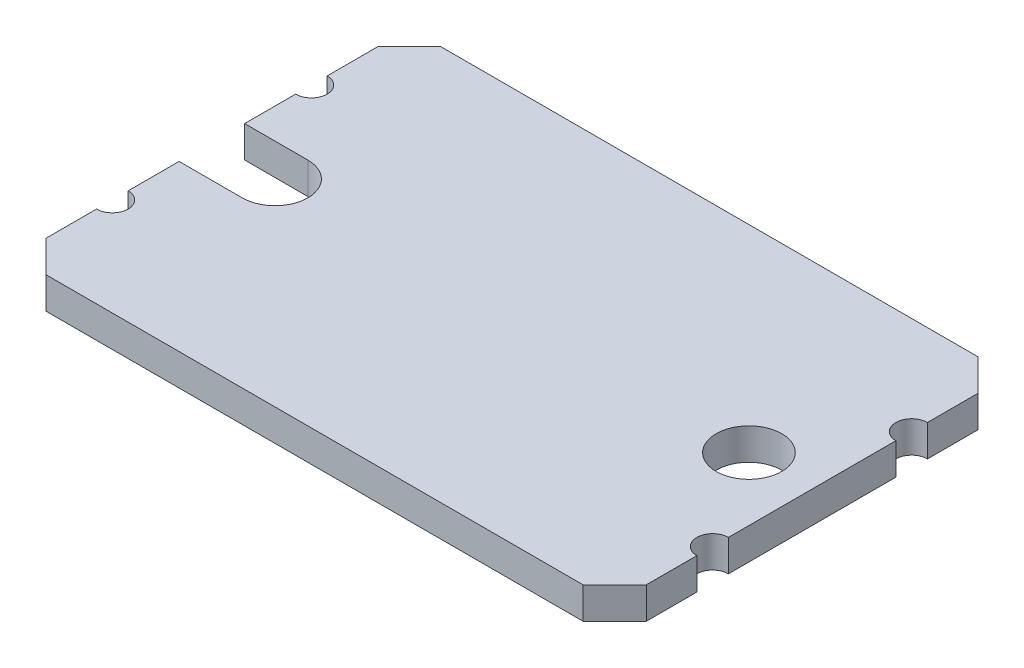
ISO-10303-21;
HEADER;
FILE_DESCRIPTION(('STEP AP214'),'2;1');
FILE_NAME('part.step','',(''),(''),'','','');
FILE_SCHEMA(('AUTOMOTIVE_DESIGN { 1 0 10303 214 1 1 1 1 }'));
ENDSEC;
DATA;
#1=APPLICATION_CONTEXT('core data for automotive mechanical design processes');
#2=APPLICATION_PROTOCOL_DEFINITION('international standard','automotive_design',2000,#1);
#3=PRODUCT_CONTEXT('',#1,'mechanical');
#4=PRODUCT('Part','Part','',(#3));
#5=PRODUCT_RELATED_PRODUCT_CATEGORY('part','',(#4));
#6=PRODUCT_DEFINITION_FORMATION('','',#4);
#7=PRODUCT_DEFINITION_CONTEXT('part definition',#1,'design');
#8=PRODUCT_DEFINITION('design','',#6,#7);
#9=PRODUCT_DEFINITION_SHAPE('','',#8);
#10=(LENGTH_UNIT() NAMED_UNIT(*) SI_UNIT(.MILLI.,.METRE.));
#11=(NAMED_UNIT(*) PLANE_ANGLE_UNIT() SI_UNIT($,.RADIAN.));
#12=(NAMED_UNIT(*) SI_UNIT($,.STERADIAN.) SOLID_ANGLE_UNIT());
#13=UNCERTAINTY_MEASURE_WITH_UNIT(LENGTH_MEASURE(1.E-05),#10,'distance_accuracy_value','');
#14=(GEOMETRIC_REPRESENTATION_CONTEXT(3) GLOBAL_UNCERTAINTY_ASSIGNED_CONTEXT((#13)) GLOBAL_UNIT_ASSIGNED_CONTEXT((#10,
#11,#12)) REPRESENTATION_CONTEXT('',''));
#15=CARTESIAN_POINT('',(0.,0.,0.));
#16=DIRECTION('',(0.,0.,1.));
#17=DIRECTION('',(1.,0.,0.));
#18=AXIS2_PLACEMENT_3D('',#15,#16,#17);
#19=CARTESIAN_POINT('',(4.,2.,-12.5));
#20=DIRECTION('',(0.,1.,0.));
#21=DIRECTION('',(0.,0.,1.));
#22=AXIS2_PLACEMENT_3D('',#19,#20,#21);
#23=PLANE('',#22);
#24=CARTESIAN_POINT('',(4.,2.,-12.5));
#25=DIRECTION('',(0.,-1.,0.));
#26=DIRECTION('',(0.,0.,1.));
#27=AXIS2_PLACEMENT_3D('',#24,#25,#26);
#28=CIRCLE('',#27,2.075);
#29=CARTESIAN_POINT('',(4.,2.,-14.575));
#30=VERTEX_POINT('',#29);
#31=CARTESIAN_POINT('',(4.,2.,-10.425));
#32=VERTEX_POINT('',#31);
#33=EDGE_CURVE('E238',#30,#32,#28,.T.);
#34=ORIENTED_EDGE('',*,*,#33,.T.);
#35=DIRECTION('',(-1.,0.,0.));
#36=VECTOR('',#35,1.);
#37=CARTESIAN_POINT('',(4.,2.,-10.425));
#38=LINE('',#37,#36);
#39=CARTESIAN_POINT('',(0.,2.,-10.425));
#40=VERTEX_POINT('',#39);
#41=EDGE_CURVE('E126',#32,#40,#38,.T.);
#42=ORIENTED_EDGE('',*,*,#41,.T.);
#43=DIRECTION('',(0.,0.,1.));
#44=VECTOR('',#43,1.);
#45=CARTESIAN_POINT('',(0.,2.,-7.2));
#46=LINE('',#45,#44);
#47=CARTESIAN_POINT('',(0.,2.,-7.2));
#48=VERTEX_POINT('',#47);
#49=EDGE_CURVE('E289',#40,#48,#46,.T.);
#50=ORIENTED_EDGE('',*,*,#49,.T.);
#51=CARTESIAN_POINT('',(0.,2.,-6.2));
#52=DIRECTION('',(0.,-1.,0.));
#53=DIRECTION('',(0.,0.,-1.));
#54=AXIS2_PLACEMENT_3D('',#51,#52,#53);
#55=CIRCLE('',#54,1.);
#56=CARTESIAN_POINT('',(0.,2.,-5.2));
#57=VERTEX_POINT('',#56);
#58=EDGE_CURVE('E308',#48,#57,#55,.T.);
#59=ORIENTED_EDGE('',*,*,#58,.T.);
#60=DIRECTION('',(0.,0.,1.));
#61=VECTOR('',#60,1.);
#62=CARTESIAN_POINT('',(0.,2.,-2.));
#63=LINE('',#62,#61);
#64=CARTESIAN_POINT('',(0.,2.,-2.));
#65=VERTEX_POINT('',#64);
#66=EDGE_CURVE('E305',#57,#65,#63,.T.);
#67=ORIENTED_EDGE('',*,*,#66,.T.);
#68=DIRECTION('',(0.707106781186548,0.,0.707106781186548));
#69=VECTOR('',#68,1.);
#70=CARTESIAN_POINT('',(2.,2.,0.));
#71=LINE('',#70,#69);
#72=CARTESIAN_POINT('',(2.,2.,0.));
#73=VERTEX_POINT('',#72);
#74=EDGE_CURVE('E307',#65,#73,#71,.T.);
#75=ORIENTED_EDGE('',*,*,#74,.T.);
#76=DIRECTION('',(1.,0.,0.));
#77=VECTOR('',#76,1.);
#78=CARTESIAN_POINT('',(2.,2.,0.));
#79=LINE('',#78,#77);
#80=CARTESIAN_POINT('',(36.,2.,0.));
#81=VERTEX_POINT('',#80);
#82=EDGE_CURVE('E310',#73,#81,#79,.T.);
#83=ORIENTED_EDGE('',*,*,#82,.T.);
#84=DIRECTION('',(0.707106781186549,0.,-0.707106781186546));
#85=VECTOR('',#84,1.);
#86=CARTESIAN_POINT('',(38.,2.,-2.));
#87=LINE('',#86,#85);
#88=CARTESIAN_POINT('',(38.,2.,-2.));
#89=VERTEX_POINT('',#88);
#90=EDGE_CURVE('E316',#81,#89,#87,.T.);
#91=ORIENTED_EDGE('',*,*,#90,.T.);
#92=DIRECTION('',(0.,0.,-1.));
#93=VECTOR('',#92,1.);
#94=CARTESIAN_POINT('',(38.,2.,-5.2));
#95=LINE('',#94,#93);
#96=CARTESIAN_POINT('',(38.,2.,-5.2));
#97=VERTEX_POINT('',#96);
#98=EDGE_CURVE('E318',#89,#97,#95,.T.);
#99=ORIENTED_EDGE('',*,*,#98,.T.);
#100=CARTESIAN_POINT('',(38.,2.,-6.2));
#101=DIRECTION('',(0.,-1.,0.));
#102=DIRECTION('',(0.,0.,-1.));
#103=AXIS2_PLACEMENT_3D('',#100,#101,#102);
#104=CIRCLE('',#103,1.);
#105=CARTESIAN_POINT('',(38.,2.,-7.2));
#106=VERTEX_POINT('',#105);
#107=EDGE_CURVE('E320',#97,#106,#104,.T.);
#108=ORIENTED_EDGE('',*,*,#107,.T.);
#109=DIRECTION('',(0.,0.,-1.));
#110=VECTOR('',#109,1.);
#111=CARTESIAN_POINT('',(38.,2.,-17.8));
#112=LINE('',#111,#110);
#113=CARTESIAN_POINT('',(38.,2.,-17.8));
#114=VERTEX_POINT('',#113);
#115=EDGE_CURVE('E322',#106,#114,#112,.T.);
#116=ORIENTED_EDGE('',*,*,#115,.T.);
#117=CARTESIAN_POINT('',(38.,2.,-18.8));
#118=DIRECTION('',(0.,-1.,0.));
#119=DIRECTION('',(0.,0.,-1.));
#120=AXIS2_PLACEMENT_3D('',#117,#118,#119);
#121=CIRCLE('',#120,1.);
#122=CARTESIAN_POINT('',(38.,2.,-19.8));
#123=VERTEX_POINT('',#122);
#124=EDGE_CURVE('E324',#114,#123,#121,.T.);
#125=ORIENTED_EDGE('',*,*,#124,.T.);
#126=DIRECTION('',(0.,0.,-1.));
#127=VECTOR('',#126,1.);
#128=CARTESIAN_POINT('',(38.,2.,-23.));
#129=LINE('',#128,#127);
#130=CARTESIAN_POINT('',(38.,2.,-23.));
#131=VERTEX_POINT('',#130);
#132=EDGE_CURVE('E326',#123,#131,#129,.T.);
#133=ORIENTED_EDGE('',*,*,#132,.T.);
#134=DIRECTION('',(-0.707106781186546,0.,-0.707106781186549));
#135=VECTOR('',#134,1.);
#136=CARTESIAN_POINT('',(36.,2.,-25.));
#137=LINE('',#136,#135);
#138=CARTESIAN_POINT('',(36.,2.,-25.));
#139=VERTEX_POINT('',#138);
#140=EDGE_CURVE('E328',#131,#139,#137,.T.);
#141=ORIENTED_EDGE('',*,*,#140,.T.);
#142=DIRECTION('',(-1.,0.,0.));
#143=VECTOR('',#142,1.);
#144=CARTESIAN_POINT('',(2.,2.,-25.));
#145=LINE('',#144,#143);
#146=CARTESIAN_POINT('',(2.,2.,-25.));
#147=VERTEX_POINT('',#146);
#148=EDGE_CURVE('E330',#139,#147,#145,.T.);
#149=ORIENTED_EDGE('',*,*,#148,.T.);
#150=DIRECTION('',(-0.707106781186547,0.,0.707106781186548));
#151=VECTOR('',#150,1.);
#152=CARTESIAN_POINT('',(0.,2.,-23.));
#153=LINE('',#152,#151);
#154=CARTESIAN_POINT('',(0.,2.,-23.));
#155=VERTEX_POINT('',#154);
#156=EDGE_CURVE('E332',#147,#155,#153,.T.);
#157=ORIENTED_EDGE('',*,*,#156,.T.);
#158=DIRECTION('',(0.,0.,1.));
#159=VECTOR('',#158,1.);
#160=CARTESIAN_POINT('',(0.,2.,-19.8));
#161=LINE('',#160,#159);
#162=CARTESIAN_POINT('',(0.,2.,-19.8));
#163=VERTEX_POINT('',#162);
#164=EDGE_CURVE('E181',#155,#163,#161,.T.);
#165=ORIENTED_EDGE('',*,*,#164,.T.);
#166=CARTESIAN_POINT('',(0.,2.,-18.8));
#167=DIRECTION('',(0.,-1.,0.));
#168=DIRECTION('',(0.,0.,-1.));
#169=AXIS2_PLACEMENT_3D('',#166,#167,#168);
#170=CIRCLE('',#169,1.);
#171=CARTESIAN_POINT('',(0.,2.,-17.8));
#172=VERTEX_POINT('',#171);
#173=EDGE_CURVE('E175',#163,#172,#170,.T.);
#174=ORIENTED_EDGE('',*,*,#173,.T.);
#175=DIRECTION('',(0.,0.,1.));
#176=VECTOR('',#175,1.);
#177=CARTESIAN_POINT('',(0.,2.,-14.575));
#178=LINE('',#177,#176);
#179=CARTESIAN_POINT('',(0.,2.,-14.575));
#180=VERTEX_POINT('',#179);
#181=EDGE_CURVE('E179',#172,#180,#178,.T.);
#182=ORIENTED_EDGE('',*,*,#181,.T.);
#183=DIRECTION('',(1.,0.,0.));
#184=VECTOR('',#183,1.);
#185=CARTESIAN_POINT('',(4.,2.,-14.575));
#186=LINE('',#185,#184);
#187=EDGE_CURVE('E47',#180,#30,#186,.T.);
#188=ORIENTED_EDGE('',*,*,#187,.T.);
#189=EDGE_LOOP('',(#34,#42,#50,#59,#67,#75,#83,#91,#99,#108,#116,#125,#133,#141,#149,#157,#165,
#174,#182,#188));
#190=FACE_BOUND('',#189,.T.);
#191=CARTESIAN_POINT('',(34.,2.,-12.5));
#192=DIRECTION('',(0.,1.,0.));
#193=DIRECTION('',(0.,0.,1.));
#194=AXIS2_PLACEMENT_3D('',#191,#192,#193);
#195=CIRCLE('',#194,2.075);
#196=CARTESIAN_POINT('',(34.,2.,-10.425));
#197=VERTEX_POINT('',#196);
#198=EDGE_CURVE('E203',#197,#197,#195,.T.);
#199=ORIENTED_EDGE('',*,*,#198,.F.);
#200=EDGE_LOOP('',(#199));
#201=FACE_BOUND('',#200,.T.);
#202=ADVANCED_FACE('F30',(#190,#201),#23,.T.);
#203=CARTESIAN_POINT('',(4.,0.,-12.5));
#204=DIRECTION('',(0.,1.,0.));
#205=DIRECTION('',(0.,0.,1.));
#206=AXIS2_PLACEMENT_3D('',#203,#204,#205);
#207=PLANE('',#206);
#208=CARTESIAN_POINT('',(4.,0.,-12.5));
#209=DIRECTION('',(0.,-1.,0.));
#210=DIRECTION('',(0.,0.,1.));
#211=AXIS2_PLACEMENT_3D('',#208,#209,#210);
#212=CIRCLE('',#211,2.075);
#213=CARTESIAN_POINT('',(4.,0.,-14.575));
#214=VERTEX_POINT('',#213);
#215=CARTESIAN_POINT('',(4.,0.,-10.425));
#216=VERTEX_POINT('',#215);
#217=EDGE_CURVE('E199',#214,#216,#212,.T.);
#218=ORIENTED_EDGE('',*,*,#217,.F.);
#219=DIRECTION('',(1.,0.,0.));
#220=VECTOR('',#219,1.);
#221=CARTESIAN_POINT('',(4.,0.,-14.575));
#222=LINE('',#221,#220);
#223=CARTESIAN_POINT('',(0.,0.,-14.575));
#224=VERTEX_POINT('',#223);
#225=EDGE_CURVE('E118',#224,#214,#222,.T.);
#226=ORIENTED_EDGE('',*,*,#225,.F.);
#227=DIRECTION('',(0.,0.,1.));
#228=VECTOR('',#227,1.);
#229=CARTESIAN_POINT('',(0.,0.,-14.575));
#230=LINE('',#229,#228);
#231=CARTESIAN_POINT('',(0.,0.,-17.8));
#232=VERTEX_POINT('',#231);
#233=EDGE_CURVE('E112',#232,#224,#230,.T.);
#234=ORIENTED_EDGE('',*,*,#233,.F.);
#235=CARTESIAN_POINT('',(0.,0.,-18.8));
#236=DIRECTION('',(0.,-1.,0.));
#237=DIRECTION('',(0.,0.,-1.));
#238=AXIS2_PLACEMENT_3D('',#235,#236,#237);
#239=CIRCLE('',#238,1.);
#240=CARTESIAN_POINT('',(0.,0.,-19.8));
#241=VERTEX_POINT('',#240);
#242=EDGE_CURVE('E189',#241,#232,#239,.T.);
#243=ORIENTED_EDGE('',*,*,#242,.F.);
#244=DIRECTION('',(0.,0.,1.));
#245=VECTOR('',#244,1.);
#246=CARTESIAN_POINT('',(0.,0.,-19.8));
#247=LINE('',#246,#245);
#248=CARTESIAN_POINT('',(0.,0.,-23.));
#249=VERTEX_POINT('',#248);
#250=EDGE_CURVE('E233',#249,#241,#247,.T.);
#251=ORIENTED_EDGE('',*,*,#250,.F.);
#252=DIRECTION('',(-0.707106781186547,0.,0.707106781186548));
#253=VECTOR('',#252,1.);
#254=CARTESIAN_POINT('',(0.,0.,-23.));
#255=LINE('',#254,#253);
#256=CARTESIAN_POINT('',(2.,0.,-25.));
#257=VERTEX_POINT('',#256);
#258=EDGE_CURVE('E231',#257,#249,#255,.T.);
#259=ORIENTED_EDGE('',*,*,#258,.F.);
#260=DIRECTION('',(-1.,0.,0.));
#261=VECTOR('',#260,1.);
#262=CARTESIAN_POINT('',(2.,0.,-25.));
#263=LINE('',#262,#261);
#264=CARTESIAN_POINT('',(36.,0.,-25.));
#265=VERTEX_POINT('',#264);
#266=EDGE_CURVE('E229',#265,#257,#263,.T.);
#267=ORIENTED_EDGE('',*,*,#266,.F.);
#268=DIRECTION('',(-0.707106781186546,0.,-0.707106781186549));
#269=VECTOR('',#268,1.);
#270=CARTESIAN_POINT('',(36.,0.,-25.));
#271=LINE('',#270,#269);
#272=CARTESIAN_POINT('',(38.,0.,-23.));
#273=VERTEX_POINT('',#272);
#274=EDGE_CURVE('E227',#273,#265,#271,.T.);
#275=ORIENTED_EDGE('',*,*,#274,.F.);
#276=DIRECTION('',(0.,0.,-1.));
#277=VECTOR('',#276,1.);
#278=CARTESIAN_POINT('',(38.,0.,-23.));
#279=LINE('',#278,#277);
#280=CARTESIAN_POINT('',(38.,0.,-19.8));
#281=VERTEX_POINT('',#280);
#282=EDGE_CURVE('E225',#281,#273,#279,.T.);
#283=ORIENTED_EDGE('',*,*,#282,.F.);
#284=CARTESIAN_POINT('',(38.,0.,-18.8));
#285=DIRECTION('',(0.,-1.,0.));
#286=DIRECTION('',(0.,0.,-1.));
#287=AXIS2_PLACEMENT_3D('',#284,#285,#286);
#288=CIRCLE('',#287,1.);
#289=CARTESIAN_POINT('',(38.,0.,-17.8));
#290=VERTEX_POINT('',#289);
#291=EDGE_CURVE('E223',#290,#281,#288,.T.);
#292=ORIENTED_EDGE('',*,*,#291,.F.);
#293=DIRECTION('',(0.,0.,-1.));
#294=VECTOR('',#293,1.);
#295=CARTESIAN_POINT('',(38.,0.,-17.8));
#296=LINE('',#295,#294);
#297=CARTESIAN_POINT('',(38.,0.,-7.2));
#298=VERTEX_POINT('',#297);
#299=EDGE_CURVE('E221',#298,#290,#296,.T.);
#300=ORIENTED_EDGE('',*,*,#299,.F.);
#301=CARTESIAN_POINT('',(38.,0.,-6.2));
#302=DIRECTION('',(0.,-1.,0.));
#303=DIRECTION('',(0.,0.,-1.));
#304=AXIS2_PLACEMENT_3D('',#301,#302,#303);
#305=CIRCLE('',#304,1.);
#306=CARTESIAN_POINT('',(38.,0.,-5.2));
#307=VERTEX_POINT('',#306);
#308=EDGE_CURVE('E219',#307,#298,#305,.T.);
#309=ORIENTED_EDGE('',*,*,#308,.F.);
#310=DIRECTION('',(0.,0.,-1.));
#311=VECTOR('',#310,1.);
#312=CARTESIAN_POINT('',(38.,0.,-5.2));
#313=LINE('',#312,#311);
#314=CARTESIAN_POINT('',(38.,0.,-2.));
#315=VERTEX_POINT('',#314);
#316=EDGE_CURVE('E217',#315,#307,#313,.T.);
#317=ORIENTED_EDGE('',*,*,#316,.F.);
#318=DIRECTION('',(0.707106781186549,0.,-0.707106781186546));
#319=VECTOR('',#318,1.);
#320=CARTESIAN_POINT('',(38.,0.,-2.));
#321=LINE('',#320,#319);
#322=CARTESIAN_POINT('',(36.,0.,0.));
#323=VERTEX_POINT('',#322);
#324=EDGE_CURVE('E215',#323,#315,#321,.T.);
#325=ORIENTED_EDGE('',*,*,#324,.F.);
#326=DIRECTION('',(1.,0.,0.));
#327=VECTOR('',#326,1.);
#328=CARTESIAN_POINT('',(2.,0.,0.));
#329=LINE('',#328,#327);
#330=CARTESIAN_POINT('',(2.,0.,0.));
#331=VERTEX_POINT('',#330);
#332=EDGE_CURVE('E213',#331,#323,#329,.T.);
#333=ORIENTED_EDGE('',*,*,#332,.F.);
#334=DIRECTION('',(0.707106781186548,0.,0.707106781186548));
#335=VECTOR('',#334,1.);
#336=CARTESIAN_POINT('',(2.,0.,0.));
#337=LINE('',#336,#335);
#338=CARTESIAN_POINT('',(0.,0.,-2.));
#339=VERTEX_POINT('',#338);
#340=EDGE_CURVE('E211',#339,#331,#337,.T.);
#341=ORIENTED_EDGE('',*,*,#340,.F.);
#342=DIRECTION('',(0.,0.,1.));
#343=VECTOR('',#342,1.);
#344=CARTESIAN_POINT('',(0.,0.,-2.));
#345=LINE('',#344,#343);
#346=CARTESIAN_POINT('',(0.,0.,-5.2));
#347=VERTEX_POINT('',#346);
#348=EDGE_CURVE('E209',#347,#339,#345,.T.);
#349=ORIENTED_EDGE('',*,*,#348,.F.);
#350=CARTESIAN_POINT('',(0.,0.,-6.2));
#351=DIRECTION('',(0.,-1.,0.));
#352=DIRECTION('',(0.,0.,-1.));
#353=AXIS2_PLACEMENT_3D('',#350,#351,#352);
#354=CIRCLE('',#353,1.);
#355=CARTESIAN_POINT('',(0.,0.,-7.2));
#356=VERTEX_POINT('',#355);
#357=EDGE_CURVE('E207',#356,#347,#354,.T.);
#358=ORIENTED_EDGE('',*,*,#357,.F.);
#359=DIRECTION('',(0.,0.,1.));
#360=VECTOR('',#359,1.);
#361=CARTESIAN_POINT('',(0.,0.,-7.2));
#362=LINE('',#361,#360);
#363=CARTESIAN_POINT('',(0.,0.,-10.425));
#364=VERTEX_POINT('',#363);
#365=EDGE_CURVE('E205',#364,#356,#362,.T.);
#366=ORIENTED_EDGE('',*,*,#365,.F.);
#367=DIRECTION('',(-1.,0.,0.));
#368=VECTOR('',#367,1.);
#369=CARTESIAN_POINT('',(4.,0.,-10.425));
#370=LINE('',#369,#368);
#371=EDGE_CURVE('E202',#216,#364,#370,.T.);
#372=ORIENTED_EDGE('',*,*,#371,.F.);
#373=EDGE_LOOP('',(#218,#226,#234,#243,#251,#259,#267,#275,#283,#292,#300,#309,#317,#325,#333,
#341,#349,#358,#366,#372));
#374=FACE_BOUND('',#373,.T.);
#375=CARTESIAN_POINT('',(34.,0.,-12.5));
#376=DIRECTION('',(0.,1.,0.));
#377=DIRECTION('',(0.,0.,1.));
#378=AXIS2_PLACEMENT_3D('',#375,#376,#377);
#379=CIRCLE('',#378,2.075);
#380=CARTESIAN_POINT('',(34.,0.,-10.425));
#381=VERTEX_POINT('',#380);
#382=EDGE_CURVE('E583',#381,#381,#379,.T.);
#383=ORIENTED_EDGE('',*,*,#382,.T.);
#384=EDGE_LOOP('',(#383));
#385=FACE_BOUND('',#384,.T.);
#386=ADVANCED_FACE('F293',(#374,#385),#207,.F.);
#387=CARTESIAN_POINT('',(4.,2.,-12.5));
#388=DIRECTION('',(0.,-1.,0.));
#389=DIRECTION('',(0.,0.,-1.));
#390=AXIS2_PLACEMENT_3D('',#387,#388,#389);
#391=CYLINDRICAL_SURFACE('',#390,2.075);
#392=ORIENTED_EDGE('',*,*,#217,.T.);
#393=DIRECTION('',(0.,-1.,0.));
#394=VECTOR('',#393,1.);
#395=CARTESIAN_POINT('',(4.,2.,-10.425));
#396=LINE('',#395,#394);
#397=EDGE_CURVE('E11',#32,#216,#396,.T.);
#398=ORIENTED_EDGE('',*,*,#397,.F.);
#399=ORIENTED_EDGE('',*,*,#33,.F.);
#400=DIRECTION('',(0.,-1.,0.));
#401=VECTOR('',#400,1.);
#402=CARTESIAN_POINT('',(4.,2.,-14.575));
#403=LINE('',#402,#401);
#404=EDGE_CURVE('E195',#30,#214,#403,.T.);
#405=ORIENTED_EDGE('',*,*,#404,.T.);
#406=EDGE_LOOP('',(#392,#398,#399,#405));
#407=FACE_BOUND('',#406,.T.);
#408=ADVANCED_FACE('F32',(#407),#391,.F.);
#409=CARTESIAN_POINT('',(4.,2.,-10.425));
#410=DIRECTION('',(0.,0.,1.));
#411=DIRECTION('',(1.,0.,0.));
#412=AXIS2_PLACEMENT_3D('',#409,#410,#411);
#413=PLANE('',#412);
#414=ORIENTED_EDGE('',*,*,#371,.T.);
#415=DIRECTION('',(0.,-1.,0.));
#416=VECTOR('',#415,1.);
#417=CARTESIAN_POINT('',(0.,2.,-10.425));
#418=LINE('',#417,#416);
#419=EDGE_CURVE('E39',#40,#364,#418,.T.);
#420=ORIENTED_EDGE('',*,*,#419,.F.);
#421=ORIENTED_EDGE('',*,*,#41,.F.);
#422=ORIENTED_EDGE('',*,*,#397,.T.);
#423=EDGE_LOOP('',(#414,#420,#421,#422));
#424=FACE_BOUND('',#423,.T.);
#425=ADVANCED_FACE('F366',(#424),#413,.F.);
#426=CARTESIAN_POINT('',(0.,2.,-7.2));
#427=DIRECTION('',(1.,0.,0.));
#428=DIRECTION('',(0.,0.,-1.));
#429=AXIS2_PLACEMENT_3D('',#426,#427,#428);
#430=PLANE('',#429);
#431=ORIENTED_EDGE('',*,*,#365,.T.);
#432=DIRECTION('',(0.,-1.,0.));
#433=VECTOR('',#432,1.);
#434=CARTESIAN_POINT('',(0.,2.,-7.2));
#435=LINE('',#434,#433);
#436=EDGE_CURVE('E281',#48,#356,#435,.T.);
#437=ORIENTED_EDGE('',*,*,#436,.F.);
#438=ORIENTED_EDGE('',*,*,#49,.F.);
#439=ORIENTED_EDGE('',*,*,#419,.T.);
#440=EDGE_LOOP('',(#431,#437,#438,#439));
#441=FACE_BOUND('',#440,.T.);
#442=ADVANCED_FACE('F287',(#441),#430,.F.);
#443=CARTESIAN_POINT('',(0.,2.,-6.2));
#444=DIRECTION('',(0.,-1.,0.));
#445=DIRECTION('',(0.,0.,-1.));
#446=AXIS2_PLACEMENT_3D('',#443,#444,#445);
#447=CYLINDRICAL_SURFACE('',#446,1.);
#448=ORIENTED_EDGE('',*,*,#357,.T.);
#449=DIRECTION('',(0.,-1.,0.));
#450=VECTOR('',#449,1.);
#451=CARTESIAN_POINT('',(0.,2.,-5.2));
#452=LINE('',#451,#450);
#453=EDGE_CURVE('E278',#57,#347,#452,.T.);
#454=ORIENTED_EDGE('',*,*,#453,.F.);
#455=ORIENTED_EDGE('',*,*,#58,.F.);
#456=ORIENTED_EDGE('',*,*,#436,.T.);
#457=EDGE_LOOP('',(#448,#454,#455,#456));
#458=FACE_BOUND('',#457,.T.);
#459=ADVANCED_FACE('F299',(#458),#447,.F.);
#460=CARTESIAN_POINT('',(0.,2.,-2.));
#461=DIRECTION('',(1.,0.,0.));
#462=DIRECTION('',(0.,0.,-1.));
#463=AXIS2_PLACEMENT_3D('',#460,#461,#462);
#464=PLANE('',#463);
#465=ORIENTED_EDGE('',*,*,#348,.T.);
#466=DIRECTION('',(0.,-1.,0.));
#467=VECTOR('',#466,1.);
#468=CARTESIAN_POINT('',(0.,2.,-2.));
#469=LINE('',#468,#467);
#470=EDGE_CURVE('E275',#65,#339,#469,.T.);
#471=ORIENTED_EDGE('',*,*,#470,.F.);
#472=ORIENTED_EDGE('',*,*,#66,.F.);
#473=ORIENTED_EDGE('',*,*,#453,.T.);
#474=EDGE_LOOP('',(#465,#471,#472,#473));
#475=FACE_BOUND('',#474,.T.);
#476=ADVANCED_FACE('F303',(#475),#464,.F.);
#477=CARTESIAN_POINT('',(2.,2.,0.));
#478=DIRECTION('',(0.707106781186547,0.,-0.707106781186547));
#479=DIRECTION('',(-0.707106781186548,0.,-0.707106781186548));
#480=AXIS2_PLACEMENT_3D('',#477,#478,#479);
#481=PLANE('',#480);
#482=ORIENTED_EDGE('',*,*,#340,.T.);
#483=DIRECTION('',(0.,-1.,0.));
#484=VECTOR('',#483,1.);
#485=CARTESIAN_POINT('',(2.,2.,0.));
#486=LINE('',#485,#484);
#487=EDGE_CURVE('E272',#73,#331,#486,.T.);
#488=ORIENTED_EDGE('',*,*,#487,.F.);
#489=ORIENTED_EDGE('',*,*,#74,.F.);
#490=ORIENTED_EDGE('',*,*,#470,.T.);
#491=EDGE_LOOP('',(#482,#488,#489,#490));
#492=FACE_BOUND('',#491,.T.);
#493=ADVANCED_FACE('F379',(#492),#481,.F.);
#494=CARTESIAN_POINT('',(2.,2.,0.));
#495=DIRECTION('',(0.,0.,-1.));
#496=DIRECTION('',(-1.,0.,0.));
#497=AXIS2_PLACEMENT_3D('',#494,#495,#496);
#498=PLANE('',#497);
#499=ORIENTED_EDGE('',*,*,#332,.T.);
#500=DIRECTION('',(0.,-1.,0.));
#501=VECTOR('',#500,1.);
#502=CARTESIAN_POINT('',(36.,2.,0.));
#503=LINE('',#502,#501);
#504=EDGE_CURVE('E269',#81,#323,#503,.T.);
#505=ORIENTED_EDGE('',*,*,#504,.F.);
#506=ORIENTED_EDGE('',*,*,#82,.F.);
#507=ORIENTED_EDGE('',*,*,#487,.T.);
#508=EDGE_LOOP('',(#499,#505,#506,#507));
#509=FACE_BOUND('',#508,.T.);
#510=ADVANCED_FACE('F382',(#509),#498,.F.);
#511=CARTESIAN_POINT('',(38.,2.,-2.));
#512=DIRECTION('',(-0.707106781186546,0.,-0.707106781186549));
#513=DIRECTION('',(-0.707106781186549,0.,0.707106781186546));
#514=AXIS2_PLACEMENT_3D('',#511,#512,#513);
#515=PLANE('',#514);
#516=ORIENTED_EDGE('',*,*,#324,.T.);
#517=DIRECTION('',(0.,-1.,0.));
#518=VECTOR('',#517,1.);
#519=CARTESIAN_POINT('',(38.,2.,-2.));
#520=LINE('',#519,#518);
#521=EDGE_CURVE('E266',#89,#315,#520,.T.);
#522=ORIENTED_EDGE('',*,*,#521,.F.);
#523=ORIENTED_EDGE('',*,*,#90,.F.);
#524=ORIENTED_EDGE('',*,*,#504,.T.);
#525=EDGE_LOOP('',(#516,#522,#523,#524));
#526=FACE_BOUND('',#525,.T.);
#527=ADVANCED_FACE('F386',(#526),#515,.F.);
#528=CARTESIAN_POINT('',(38.,2.,-5.2));
#529=DIRECTION('',(-1.,0.,0.));
#530=DIRECTION('',(0.,0.,1.));
#531=AXIS2_PLACEMENT_3D('',#528,#529,#530);
#532=PLANE('',#531);
#533=ORIENTED_EDGE('',*,*,#316,.T.);
#534=DIRECTION('',(0.,-1.,0.));
#535=VECTOR('',#534,1.);
#536=CARTESIAN_POINT('',(38.,2.,-5.2));
#537=LINE('',#536,#535);
#538=EDGE_CURVE('E263',#97,#307,#537,.T.);
#539=ORIENTED_EDGE('',*,*,#538,.F.);
#540=ORIENTED_EDGE('',*,*,#98,.F.);
#541=ORIENTED_EDGE('',*,*,#521,.T.);
#542=EDGE_LOOP('',(#533,#539,#540,#541));
#543=FACE_BOUND('',#542,.T.);
#544=ADVANCED_FACE('F390',(#543),#532,.F.);
#545=CARTESIAN_POINT('',(38.,2.,-6.2));
#546=DIRECTION('',(0.,-1.,0.));
#547=DIRECTION('',(0.,0.,-1.));
#548=AXIS2_PLACEMENT_3D('',#545,#546,#547);
#549=CYLINDRICAL_SURFACE('',#548,1.);
#550=ORIENTED_EDGE('',*,*,#308,.T.);
#551=DIRECTION('',(0.,-1.,0.));
#552=VECTOR('',#551,1.);
#553=CARTESIAN_POINT('',(38.,2.,-7.2));
#554=LINE('',#553,#552);
#555=EDGE_CURVE('E260',#106,#298,#554,.T.);
#556=ORIENTED_EDGE('',*,*,#555,.F.);
#557=ORIENTED_EDGE('',*,*,#107,.F.);
#558=ORIENTED_EDGE('',*,*,#538,.T.);
#559=EDGE_LOOP('',(#550,#556,#557,#558));
#560=FACE_BOUND('',#559,.T.);
#561=ADVANCED_FACE('F394',(#560),#549,.F.);
#562=CARTESIAN_POINT('',(38.,2.,-17.8));
#563=DIRECTION('',(-1.,0.,0.));
#564=DIRECTION('',(0.,0.,1.));
#565=AXIS2_PLACEMENT_3D('',#562,#563,#564);
#566=PLANE('',#565);
#567=ORIENTED_EDGE('',*,*,#299,.T.);
#568=DIRECTION('',(0.,-1.,0.));
#569=VECTOR('',#568,1.);
#570=CARTESIAN_POINT('',(38.,2.,-17.8));
#571=LINE('',#570,#569);
#572=EDGE_CURVE('E257',#114,#290,#571,.T.);
#573=ORIENTED_EDGE('',*,*,#572,.F.);
#574=ORIENTED_EDGE('',*,*,#115,.F.);
#575=ORIENTED_EDGE('',*,*,#555,.T.);
#576=EDGE_LOOP('',(#567,#573,#574,#575));
#577=FACE_BOUND('',#576,.T.);
#578=ADVANCED_FACE('F398',(#577),#566,.F.);
#579=CARTESIAN_POINT('',(38.,2.,-18.8));
#580=DIRECTION('',(0.,-1.,0.));
#581=DIRECTION('',(0.,0.,-1.));
#582=AXIS2_PLACEMENT_3D('',#579,#580,#581);
#583=CYLINDRICAL_SURFACE('',#582,1.);
#584=ORIENTED_EDGE('',*,*,#291,.T.);
#585=DIRECTION('',(0.,-1.,0.));
#586=VECTOR('',#585,1.);
#587=CARTESIAN_POINT('',(38.,2.,-19.8));
#588=LINE('',#587,#586);
#589=EDGE_CURVE('E254',#123,#281,#588,.T.);
#590=ORIENTED_EDGE('',*,*,#589,.F.);
#591=ORIENTED_EDGE('',*,*,#124,.F.);
#592=ORIENTED_EDGE('',*,*,#572,.T.);
#593=EDGE_LOOP('',(#584,#590,#591,#592));
#594=FACE_BOUND('',#593,.T.);
#595=ADVANCED_FACE('F402',(#594),#583,.F.);
#596=CARTESIAN_POINT('',(38.,2.,-23.));
#597=DIRECTION('',(-1.,0.,0.));
#598=DIRECTION('',(0.,0.,1.));
#599=AXIS2_PLACEMENT_3D('',#596,#597,#598);
#600=PLANE('',#599);
#601=ORIENTED_EDGE('',*,*,#282,.T.);
#602=DIRECTION('',(0.,-1.,0.));
#603=VECTOR('',#602,1.);
#604=CARTESIAN_POINT('',(38.,2.,-23.));
#605=LINE('',#604,#603);
#606=EDGE_CURVE('E251',#131,#273,#605,.T.);
#607=ORIENTED_EDGE('',*,*,#606,.F.);
#608=ORIENTED_EDGE('',*,*,#132,.F.);
#609=ORIENTED_EDGE('',*,*,#589,.T.);
#610=EDGE_LOOP('',(#601,#607,#608,#609));
#611=FACE_BOUND('',#610,.T.);
#612=ADVANCED_FACE('F406',(#611),#600,.F.);
#613=CARTESIAN_POINT('',(36.,2.,-25.));
#614=DIRECTION('',(-0.707106781186549,0.,0.707106781186546));
#615=DIRECTION('',(0.707106781186546,0.,0.707106781186549));
#616=AXIS2_PLACEMENT_3D('',#613,#614,#615);
#617=PLANE('',#616);
#618=ORIENTED_EDGE('',*,*,#274,.T.);
#619=DIRECTION('',(0.,-1.,0.));
#620=VECTOR('',#619,1.);
#621=CARTESIAN_POINT('',(36.,2.,-25.));
#622=LINE('',#621,#620);
#623=EDGE_CURVE('E248',#139,#265,#622,.T.);
#624=ORIENTED_EDGE('',*,*,#623,.F.);
#625=ORIENTED_EDGE('',*,*,#140,.F.);
#626=ORIENTED_EDGE('',*,*,#606,.T.);
#627=EDGE_LOOP('',(#618,#624,#625,#626));
#628=FACE_BOUND('',#627,.T.);
#629=ADVANCED_FACE('F410',(#628),#617,.F.);
#630=CARTESIAN_POINT('',(2.,2.,-25.));
#631=DIRECTION('',(0.,0.,1.));
#632=DIRECTION('',(1.,0.,0.));
#633=AXIS2_PLACEMENT_3D('',#630,#631,#632);
#634=PLANE('',#633);
#635=ORIENTED_EDGE('',*,*,#266,.T.);
#636=DIRECTION('',(0.,-1.,0.));
#637=VECTOR('',#636,1.);
#638=CARTESIAN_POINT('',(2.,2.,-25.));
#639=LINE('',#638,#637);
#640=EDGE_CURVE('E245',#147,#257,#639,.T.);
#641=ORIENTED_EDGE('',*,*,#640,.F.);
#642=ORIENTED_EDGE('',*,*,#148,.F.);
#643=ORIENTED_EDGE('',*,*,#623,.T.);
#644=EDGE_LOOP('',(#635,#641,#642,#643));
#645=FACE_BOUND('',#644,.T.);
#646=ADVANCED_FACE('F414',(#645),#634,.F.);
#647=CARTESIAN_POINT('',(0.,2.,-23.));
#648=DIRECTION('',(0.707106781186548,0.,0.707106781186547));
#649=DIRECTION('',(0.707106781186547,0.,-0.707106781186548));
#650=AXIS2_PLACEMENT_3D('',#647,#648,#649);
#651=PLANE('',#650);
#652=ORIENTED_EDGE('',*,*,#258,.T.);
#653=DIRECTION('',(0.,-1.,0.));
#654=VECTOR('',#653,1.);
#655=CARTESIAN_POINT('',(0.,2.,-23.));
#656=LINE('',#655,#654);
#657=EDGE_CURVE('E242',#155,#249,#656,.T.);
#658=ORIENTED_EDGE('',*,*,#657,.F.);
#659=ORIENTED_EDGE('',*,*,#156,.F.);
#660=ORIENTED_EDGE('',*,*,#640,.T.);
#661=EDGE_LOOP('',(#652,#658,#659,#660));
#662=FACE_BOUND('',#661,.T.);
#663=ADVANCED_FACE('F338',(#662),#651,.F.);
#664=CARTESIAN_POINT('',(0.,2.,-19.8));
#665=DIRECTION('',(1.,0.,0.));
#666=DIRECTION('',(0.,0.,-1.));
#667=AXIS2_PLACEMENT_3D('',#664,#665,#666);
#668=PLANE('',#667);
#669=ORIENTED_EDGE('',*,*,#250,.T.);
#670=DIRECTION('',(0.,-1.,0.));
#671=VECTOR('',#670,1.);
#672=CARTESIAN_POINT('',(0.,2.,-19.8));
#673=LINE('',#672,#671);
#674=EDGE_CURVE('E190',#163,#241,#673,.T.);
#675=ORIENTED_EDGE('',*,*,#674,.F.);
#676=ORIENTED_EDGE('',*,*,#164,.F.);
#677=ORIENTED_EDGE('',*,*,#657,.T.);
#678=EDGE_LOOP('',(#669,#675,#676,#677));
#679=FACE_BOUND('',#678,.T.);
#680=ADVANCED_FACE('F342',(#679),#668,.F.);
#681=CARTESIAN_POINT('',(0.,2.,-18.8));
#682=DIRECTION('',(0.,-1.,0.));
#683=DIRECTION('',(0.,0.,-1.));
#684=AXIS2_PLACEMENT_3D('',#681,#682,#683);
#685=CYLINDRICAL_SURFACE('',#684,1.);
#686=ORIENTED_EDGE('',*,*,#242,.T.);
#687=DIRECTION('',(0.,-1.,0.));
#688=VECTOR('',#687,1.);
#689=CARTESIAN_POINT('',(0.,2.,-17.8));
#690=LINE('',#689,#688);
#691=EDGE_CURVE('E186',#172,#232,#690,.T.);
#692=ORIENTED_EDGE('',*,*,#691,.F.);
#693=ORIENTED_EDGE('',*,*,#173,.F.);
#694=ORIENTED_EDGE('',*,*,#674,.T.);
#695=EDGE_LOOP('',(#686,#692,#693,#694));
#696=FACE_BOUND('',#695,.T.);
#697=ADVANCED_FACE('F187',(#696),#685,.F.);
#698=CARTESIAN_POINT('',(0.,2.,-14.575));
#699=DIRECTION('',(1.,0.,0.));
#700=DIRECTION('',(0.,0.,-1.));
#701=AXIS2_PLACEMENT_3D('',#698,#699,#700);
#702=PLANE('',#701);
#703=ORIENTED_EDGE('',*,*,#233,.T.);
#704=DIRECTION('',(0.,-1.,0.));
#705=VECTOR('',#704,1.);
#706=CARTESIAN_POINT('',(0.,2.,-14.575));
#707=LINE('',#706,#705);
#708=EDGE_CURVE('E191',#180,#224,#707,.T.);
#709=ORIENTED_EDGE('',*,*,#708,.F.);
#710=ORIENTED_EDGE('',*,*,#181,.F.);
#711=ORIENTED_EDGE('',*,*,#691,.T.);
#712=EDGE_LOOP('',(#703,#709,#710,#711));
#713=FACE_BOUND('',#712,.T.);
#714=ADVANCED_FACE('F193',(#713),#702,.F.);
#715=CARTESIAN_POINT('',(4.,2.,-14.575));
#716=DIRECTION('',(0.,0.,-1.));
#717=DIRECTION('',(-1.,0.,0.));
#718=AXIS2_PLACEMENT_3D('',#715,#716,#717);
#719=PLANE('',#718);
#720=ORIENTED_EDGE('',*,*,#225,.T.);
#721=ORIENTED_EDGE('',*,*,#404,.F.);
#722=ORIENTED_EDGE('',*,*,#187,.F.);
#723=ORIENTED_EDGE('',*,*,#708,.T.);
#724=EDGE_LOOP('',(#720,#721,#722,#723));
#725=FACE_BOUND('',#724,.T.);
#726=ADVANCED_FACE('F346',(#725),#719,.F.);
#727=CARTESIAN_POINT('',(34.,2.,-12.5));
#728=DIRECTION('',(0.,-1.,0.));
#729=DIRECTION('',(0.,0.,-1.));
#730=AXIS2_PLACEMENT_3D('',#727,#728,#729);
#731=CYLINDRICAL_SURFACE('',#730,2.075);
#732=ORIENTED_EDGE('',*,*,#198,.T.);
#733=EDGE_LOOP('',(#732));
#734=FACE_BOUND('',#733,.T.);
#735=ORIENTED_EDGE('',*,*,#382,.F.);
#736=EDGE_LOOP('',(#735));
#737=FACE_BOUND('',#736,.T.);
#738=ADVANCED_FACE('F348',(#734,#737),#731,.F.);
#739=CLOSED_SHELL('',(#202,#386,#408,#425,#442,#459,#476,#493,#510,#527,#544,#561,#578,#595,
#612,#629,#646,#663,#680,#697,#714,#726,#738));
#740=MANIFOLD_SOLID_BREP('B2',#739);
#741=ADVANCED_BREP_SHAPE_REPRESENTATION('',(#18,#740),#14);
#742=SHAPE_DEFINITION_REPRESENTATION(#9,#741);
ENDSEC;
END-ISO-10303-21;
